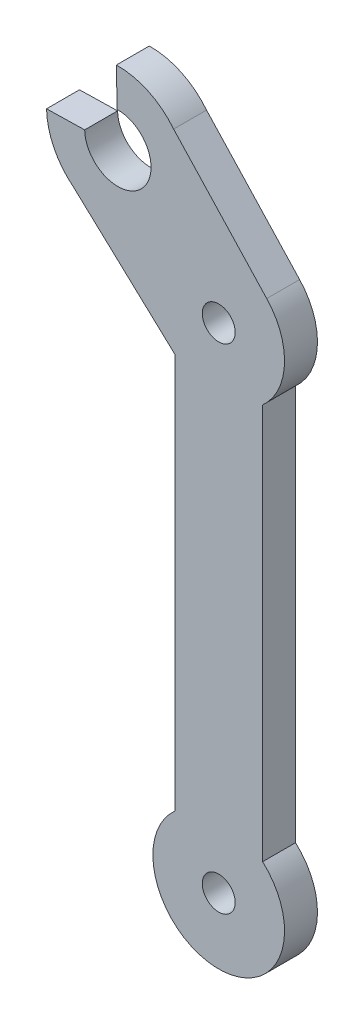
ISO-10303-21;
HEADER;
FILE_DESCRIPTION(('STEP AP214'),'2;1');
FILE_NAME('part.step','',(''),(''),'','','');
FILE_SCHEMA(('AUTOMOTIVE_DESIGN { 1 0 10303 214 1 1 1 1 }'));
ENDSEC;
DATA;
#1=APPLICATION_CONTEXT('core data for automotive mechanical design processes');
#2=APPLICATION_PROTOCOL_DEFINITION('international standard','automotive_design',2000,#1);
#3=PRODUCT_CONTEXT('',#1,'mechanical');
#4=PRODUCT('Part','Part','',(#3));
#5=PRODUCT_RELATED_PRODUCT_CATEGORY('part','',(#4));
#6=PRODUCT_DEFINITION_FORMATION('','',#4);
#7=PRODUCT_DEFINITION_CONTEXT('part definition',#1,'design');
#8=PRODUCT_DEFINITION('design','',#6,#7);
#9=PRODUCT_DEFINITION_SHAPE('','',#8);
#10=(LENGTH_UNIT() NAMED_UNIT(*) SI_UNIT(.MILLI.,.METRE.));
#11=(NAMED_UNIT(*) PLANE_ANGLE_UNIT() SI_UNIT($,.RADIAN.));
#12=(NAMED_UNIT(*) SI_UNIT($,.STERADIAN.) SOLID_ANGLE_UNIT());
#13=UNCERTAINTY_MEASURE_WITH_UNIT(LENGTH_MEASURE(1.E-05),#10,'distance_accuracy_value','');
#14=(GEOMETRIC_REPRESENTATION_CONTEXT(3) GLOBAL_UNCERTAINTY_ASSIGNED_CONTEXT((#13)) GLOBAL_UNIT_ASSIGNED_CONTEXT((#10,
#11,#12)) REPRESENTATION_CONTEXT('',''));
#15=CARTESIAN_POINT('',(0.,0.,0.));
#16=DIRECTION('',(0.,0.,1.));
#17=DIRECTION('',(1.,0.,0.));
#18=AXIS2_PLACEMENT_3D('',#15,#16,#17);
#19=CARTESIAN_POINT('',(0.,0.,3.));
#20=DIRECTION('',(-1.,0.,0.));
#21=DIRECTION('',(0.,-1.,0.));
#22=AXIS2_PLACEMENT_3D('',#19,#20,#21);
#23=PLANE('',#22);
#24=DIRECTION('',(0.,1.,0.));
#25=VECTOR('',#24,1.);
#26=CARTESIAN_POINT('',(0.,0.,0.));
#27=LINE('',#26,#25);
#28=CARTESIAN_POINT('',(0.,4.47213595499958,0.));
#29=VERTEX_POINT('',#28);
#30=CARTESIAN_POINT('',(0.,40.5278640450004,0.));
#31=VERTEX_POINT('',#30);
#32=EDGE_CURVE('E156',#29,#31,#27,.T.);
#33=ORIENTED_EDGE('',*,*,#32,.F.);
#34=DIRECTION('',(0.,0.,-1.));
#35=VECTOR('',#34,1.);
#36=CARTESIAN_POINT('',(0.,4.47213595499958,3.));
#37=LINE('',#36,#35);
#38=CARTESIAN_POINT('',(0.,4.47213595499958,3.));
#39=VERTEX_POINT('',#38);
#40=EDGE_CURVE('E11',#39,#29,#37,.T.);
#41=ORIENTED_EDGE('',*,*,#40,.F.);
#42=DIRECTION('',(0.,1.,0.));
#43=VECTOR('',#42,1.);
#44=CARTESIAN_POINT('',(0.,0.,3.));
#45=LINE('',#44,#43);
#46=CARTESIAN_POINT('',(0.,40.5278640450004,3.));
#47=VERTEX_POINT('',#46);
#48=EDGE_CURVE('E189',#39,#47,#45,.T.);
#49=ORIENTED_EDGE('',*,*,#48,.T.);
#50=DIRECTION('',(0.,0.,-1.));
#51=VECTOR('',#50,1.);
#52=CARTESIAN_POINT('',(0.,40.5278640450004,3.));
#53=LINE('',#52,#51);
#54=EDGE_CURVE('E53',#47,#31,#53,.T.);
#55=ORIENTED_EDGE('',*,*,#54,.T.);
#56=EDGE_LOOP('',(#33,#41,#49,#55));
#57=FACE_BOUND('',#56,.T.);
#58=ADVANCED_FACE('F37',(#57),#23,.T.);
#59=CARTESIAN_POINT('',(4.,0.,3.));
#60=DIRECTION('',(0.,0.,-1.));
#61=DIRECTION('',(-1.,0.,0.));
#62=AXIS2_PLACEMENT_3D('',#59,#60,#61);
#63=CYLINDRICAL_SURFACE('',#62,6.);
#64=CARTESIAN_POINT('',(4.,0.,0.));
#65=DIRECTION('',(0.,0.,1.));
#66=DIRECTION('',(1.,0.,0.));
#67=AXIS2_PLACEMENT_3D('',#64,#65,#66);
#68=CIRCLE('',#67,6.);
#69=CARTESIAN_POINT('',(8.,4.47213595499958,0.));
#70=VERTEX_POINT('',#69);
#71=EDGE_CURVE('E158',#29,#70,#68,.T.);
#72=ORIENTED_EDGE('',*,*,#71,.T.);
#73=DIRECTION('',(0.,0.,-1.));
#74=VECTOR('',#73,1.);
#75=CARTESIAN_POINT('',(8.,4.47213595499958,3.));
#76=LINE('',#75,#74);
#77=CARTESIAN_POINT('',(8.,4.47213595499958,3.));
#78=VERTEX_POINT('',#77);
#79=EDGE_CURVE('E45',#78,#70,#76,.T.);
#80=ORIENTED_EDGE('',*,*,#79,.F.);
#81=CARTESIAN_POINT('',(4.,0.,3.));
#82=DIRECTION('',(0.,0.,1.));
#83=DIRECTION('',(1.,0.,0.));
#84=AXIS2_PLACEMENT_3D('',#81,#82,#83);
#85=CIRCLE('',#84,6.);
#86=EDGE_CURVE('E230',#39,#78,#85,.T.);
#87=ORIENTED_EDGE('',*,*,#86,.F.);
#88=ORIENTED_EDGE('',*,*,#40,.T.);
#89=EDGE_LOOP('',(#72,#80,#87,#88));
#90=FACE_BOUND('',#89,.T.);
#91=ADVANCED_FACE('F256',(#90),#63,.T.);
#92=CARTESIAN_POINT('',(8.,0.,3.));
#93=DIRECTION('',(-1.,0.,0.));
#94=DIRECTION('',(0.,-1.,0.));
#95=AXIS2_PLACEMENT_3D('',#92,#93,#94);
#96=PLANE('',#95);
#97=DIRECTION('',(0.,1.,0.));
#98=VECTOR('',#97,1.);
#99=CARTESIAN_POINT('',(8.,0.,0.));
#100=LINE('',#99,#98);
#101=CARTESIAN_POINT('',(8.,40.5278640450004,0.));
#102=VERTEX_POINT('',#101);
#103=EDGE_CURVE('E160',#70,#102,#100,.T.);
#104=ORIENTED_EDGE('',*,*,#103,.T.);
#105=DIRECTION('',(0.,0.,-1.));
#106=VECTOR('',#105,1.);
#107=CARTESIAN_POINT('',(8.,40.5278640450004,3.));
#108=LINE('',#107,#106);
#109=CARTESIAN_POINT('',(8.,40.5278640450004,3.));
#110=VERTEX_POINT('',#109);
#111=EDGE_CURVE('E201',#110,#102,#108,.T.);
#112=ORIENTED_EDGE('',*,*,#111,.F.);
#113=DIRECTION('',(0.,1.,0.));
#114=VECTOR('',#113,1.);
#115=CARTESIAN_POINT('',(8.,0.,3.));
#116=LINE('',#115,#114);
#117=EDGE_CURVE('E210',#78,#110,#116,.T.);
#118=ORIENTED_EDGE('',*,*,#117,.F.);
#119=ORIENTED_EDGE('',*,*,#79,.T.);
#120=EDGE_LOOP('',(#104,#112,#118,#119));
#121=FACE_BOUND('',#120,.T.);
#122=ADVANCED_FACE('F208',(#121),#96,.F.);
#123=CARTESIAN_POINT('',(4.,45.,3.));
#124=DIRECTION('',(0.,0.,-1.));
#125=DIRECTION('',(-1.,0.,0.));
#126=AXIS2_PLACEMENT_3D('',#123,#124,#125);
#127=CYLINDRICAL_SURFACE('',#126,6.);
#128=CARTESIAN_POINT('',(4.,45.,0.));
#129=DIRECTION('',(0.,0.,1.));
#130=DIRECTION('',(1.,0.,0.));
#131=AXIS2_PLACEMENT_3D('',#128,#129,#130);
#132=CIRCLE('',#131,6.);
#133=CARTESIAN_POINT('',(8.37364085236499,49.1074646309523,0.));
#134=VERTEX_POINT('',#133);
#135=EDGE_CURVE('E162',#102,#134,#132,.T.);
#136=ORIENTED_EDGE('',*,*,#135,.T.);
#137=DIRECTION('',(0.,0.,-1.));
#138=VECTOR('',#137,1.);
#139=CARTESIAN_POINT('',(8.37364085236499,49.1074646309523,3.));
#140=LINE('',#139,#138);
#141=CARTESIAN_POINT('',(8.37364085236499,49.1074646309523,3.));
#142=VERTEX_POINT('',#141);
#143=EDGE_CURVE('E199',#142,#134,#140,.T.);
#144=ORIENTED_EDGE('',*,*,#143,.F.);
#145=CARTESIAN_POINT('',(4.,45.,3.));
#146=DIRECTION('',(0.,0.,1.));
#147=DIRECTION('',(1.,0.,0.));
#148=AXIS2_PLACEMENT_3D('',#145,#146,#147);
#149=CIRCLE('',#148,6.);
#150=EDGE_CURVE('E224',#110,#142,#149,.T.);
#151=ORIENTED_EDGE('',*,*,#150,.F.);
#152=ORIENTED_EDGE('',*,*,#111,.T.);
#153=EDGE_LOOP('',(#136,#144,#151,#152));
#154=FACE_BOUND('',#153,.T.);
#155=ADVANCED_FACE('F221',(#154),#127,.T.);
#156=CARTESIAN_POINT('',(28.983074799154,26.9119106318994,3.));
#157=DIRECTION('',(0.732805399614917,0.680438275154493,0.));
#158=DIRECTION('',(-0.680438275154493,0.732805399614917,0.));
#159=AXIS2_PLACEMENT_3D('',#156,#157,#158);
#160=PLANE('',#159);
#161=DIRECTION('',(0.680438275154493,-0.732805399614917,0.));
#162=VECTOR('',#161,1.);
#163=CARTESIAN_POINT('',(28.983074799154,26.9119106318994,0.));
#164=LINE('',#163,#162);
#165=CARTESIAN_POINT('',(-0.107464630952108,58.2412834060166,0.));
#166=VERTEX_POINT('',#165);
#167=EDGE_CURVE('E165',#166,#134,#164,.T.);
#168=ORIENTED_EDGE('',*,*,#167,.F.);
#169=DIRECTION('',(0.,0.,-1.));
#170=VECTOR('',#169,1.);
#171=CARTESIAN_POINT('',(-0.107464630952108,58.2412834060166,3.));
#172=LINE('',#171,#170);
#173=CARTESIAN_POINT('',(-0.107464630952108,58.2412834060166,3.));
#174=VERTEX_POINT('',#173);
#175=EDGE_CURVE('E197',#174,#166,#172,.T.);
#176=ORIENTED_EDGE('',*,*,#175,.F.);
#177=DIRECTION('',(0.680438275154493,-0.732805399614917,0.));
#178=VECTOR('',#177,1.);
#179=CARTESIAN_POINT('',(28.983074799154,26.9119106318994,3.));
#180=LINE('',#179,#178);
#181=EDGE_CURVE('E226',#174,#142,#180,.T.);
#182=ORIENTED_EDGE('',*,*,#181,.T.);
#183=ORIENTED_EDGE('',*,*,#143,.T.);
#184=EDGE_LOOP('',(#168,#176,#182,#183));
#185=FACE_BOUND('',#184,.T.);
#186=ADVANCED_FACE('F267',(#185),#160,.T.);
#187=CARTESIAN_POINT('',(-5.19238815542507,54.1923881554252,3.));
#188=DIRECTION('',(0.,0.,-1.));
#189=DIRECTION('',(-1.,0.,0.));
#190=AXIS2_PLACEMENT_3D('',#187,#188,#189);
#191=CYLINDRICAL_SURFACE('',#190,6.5);
#192=CARTESIAN_POINT('',(-5.19238815542507,54.1923881554252,0.));
#193=DIRECTION('',(0.,0.,1.));
#194=DIRECTION('',(1.,0.,0.));
#195=AXIS2_PLACEMENT_3D('',#192,#193,#194);
#196=CIRCLE('',#195,6.5);
#197=CARTESIAN_POINT('',(-5.32951474731763,60.690941555821,0.));
#198=VERTEX_POINT('',#197);
#199=EDGE_CURVE('E168',#166,#198,#196,.T.);
#200=ORIENTED_EDGE('',*,*,#199,.T.);
#201=DIRECTION('',(0.,0.,-1.));
#202=VECTOR('',#201,1.);
#203=CARTESIAN_POINT('',(-5.32951474731763,60.690941555821,3.));
#204=LINE('',#203,#202);
#205=CARTESIAN_POINT('',(-5.32951474731763,60.690941555821,3.));
#206=VERTEX_POINT('',#205);
#207=EDGE_CURVE('E195',#206,#198,#204,.T.);
#208=ORIENTED_EDGE('',*,*,#207,.F.);
#209=CARTESIAN_POINT('',(-5.19238815542507,54.1923881554252,3.));
#210=DIRECTION('',(0.,0.,1.));
#211=DIRECTION('',(1.,0.,0.));
#212=AXIS2_PLACEMENT_3D('',#209,#210,#211);
#213=CIRCLE('',#212,6.5);
#214=EDGE_CURVE('E228',#174,#206,#213,.T.);
#215=ORIENTED_EDGE('',*,*,#214,.F.);
#216=ORIENTED_EDGE('',*,*,#175,.T.);
#217=EDGE_LOOP('',(#200,#208,#215,#216));
#218=FACE_BOUND('',#217,.T.);
#219=ADVANCED_FACE('F270',(#218),#191,.T.);
#220=CARTESIAN_POINT('',(-4.04706744922179,-0.0853975542368137,3.));
#221=DIRECTION('',(-0.99977744621474,-0.0210963987527027,0.));
#222=DIRECTION('',(0.0210963987527027,-0.99977744621474,0.));
#223=AXIS2_PLACEMENT_3D('',#220,#221,#222);
#224=PLANE('',#223);
#225=DIRECTION('',(-0.0210963987527027,0.99977744621474,0.));
#226=VECTOR('',#225,1.);
#227=CARTESIAN_POINT('',(-4.04706744922179,-0.0853975542368137,0.));
#228=LINE('',#227,#226);
#229=CARTESIAN_POINT('',(-5.25620476165199,57.2167149302248,0.));
#230=VERTEX_POINT('',#229);
#231=EDGE_CURVE('E171',#230,#198,#228,.T.);
#232=ORIENTED_EDGE('',*,*,#231,.F.);
#233=DIRECTION('',(0.,0.,-1.));
#234=VECTOR('',#233,1.);
#235=CARTESIAN_POINT('',(-5.25620476165199,57.2167149302248,3.));
#236=LINE('',#235,#234);
#237=CARTESIAN_POINT('',(-5.25620476165199,57.2167149302248,3.));
#238=VERTEX_POINT('',#237);
#239=EDGE_CURVE('E193',#238,#230,#236,.T.);
#240=ORIENTED_EDGE('',*,*,#239,.F.);
#241=DIRECTION('',(-0.0210963987527027,0.99977744621474,0.));
#242=VECTOR('',#241,1.);
#243=CARTESIAN_POINT('',(-4.04706744922179,-0.0853975542368137,3.));
#244=LINE('',#243,#242);
#245=EDGE_CURVE('E235',#238,#206,#244,.T.);
#246=ORIENTED_EDGE('',*,*,#245,.T.);
#247=ORIENTED_EDGE('',*,*,#207,.T.);
#248=EDGE_LOOP('',(#232,#240,#246,#247));
#249=FACE_BOUND('',#248,.T.);
#250=ADVANCED_FACE('F274',(#249),#224,.T.);
#251=CARTESIAN_POINT('',(-5.19238815542507,54.1923881554252,3.));
#252=DIRECTION('',(0.,0.,-1.));
#253=DIRECTION('',(-1.,0.,0.));
#254=AXIS2_PLACEMENT_3D('',#251,#252,#253);
#255=CYLINDRICAL_SURFACE('',#254,3.025);
#256=CARTESIAN_POINT('',(-5.19238815542507,54.1923881554252,0.));
#257=DIRECTION('',(0.,0.,1.));
#258=DIRECTION('',(1.,0.,0.));
#259=AXIS2_PLACEMENT_3D('',#256,#257,#258);
#260=CIRCLE('',#259,3.025);
#261=CARTESIAN_POINT('',(-8.21671493022465,54.1285715491982,0.));
#262=VERTEX_POINT('',#261);
#263=EDGE_CURVE('E174',#262,#230,#260,.T.);
#264=ORIENTED_EDGE('',*,*,#263,.F.);
#265=DIRECTION('',(0.,0.,-1.));
#266=VECTOR('',#265,1.);
#267=CARTESIAN_POINT('',(-8.21671493022465,54.1285715491982,3.));
#268=LINE('',#267,#266);
#269=CARTESIAN_POINT('',(-8.21671493022465,54.1285715491982,3.));
#270=VERTEX_POINT('',#269);
#271=EDGE_CURVE('E142',#270,#262,#268,.T.);
#272=ORIENTED_EDGE('',*,*,#271,.F.);
#273=CARTESIAN_POINT('',(-5.19238815542507,54.1923881554252,3.));
#274=DIRECTION('',(0.,0.,1.));
#275=DIRECTION('',(1.,0.,0.));
#276=AXIS2_PLACEMENT_3D('',#273,#274,#275);
#277=CIRCLE('',#276,3.025);
#278=EDGE_CURVE('E132',#270,#238,#277,.T.);
#279=ORIENTED_EDGE('',*,*,#278,.T.);
#280=ORIENTED_EDGE('',*,*,#239,.T.);
#281=EDGE_LOOP('',(#264,#272,#279,#280));
#282=FACE_BOUND('',#281,.T.);
#283=ADVANCED_FACE('F239',(#282),#255,.F.);
#284=CARTESIAN_POINT('',(-1.14532070620347,54.277785709662,3.));
#285=DIRECTION('',(0.0210963987527061,-0.99977744621474,0.));
#286=DIRECTION('',(0.99977744621474,0.0210963987527061,0.));
#287=AXIS2_PLACEMENT_3D('',#284,#285,#286);
#288=PLANE('',#287);
#289=DIRECTION('',(-0.99977744621474,-0.0210963987527061,0.));
#290=VECTOR('',#289,1.);
#291=CARTESIAN_POINT('',(-1.14532070620347,54.277785709662,0.));
#292=LINE('',#291,#290);
#293=CARTESIAN_POINT('',(-11.6909415558209,54.0552615635326,0.));
#294=VERTEX_POINT('',#293);
#295=EDGE_CURVE('E139',#262,#294,#292,.T.);
#296=ORIENTED_EDGE('',*,*,#295,.T.);
#297=DIRECTION('',(0.,0.,-1.));
#298=VECTOR('',#297,1.);
#299=CARTESIAN_POINT('',(-11.6909415558209,54.0552615635326,3.));
#300=LINE('',#299,#298);
#301=CARTESIAN_POINT('',(-11.6909415558209,54.0552615635326,3.));
#302=VERTEX_POINT('',#301);
#303=EDGE_CURVE('E136',#302,#294,#300,.T.);
#304=ORIENTED_EDGE('',*,*,#303,.F.);
#305=DIRECTION('',(-0.99977744621474,-0.0210963987527061,0.));
#306=VECTOR('',#305,1.);
#307=CARTESIAN_POINT('',(-1.14532070620347,54.277785709662,3.));
#308=LINE('',#307,#306);
#309=EDGE_CURVE('E122',#270,#302,#308,.T.);
#310=ORIENTED_EDGE('',*,*,#309,.F.);
#311=ORIENTED_EDGE('',*,*,#271,.T.);
#312=EDGE_LOOP('',(#296,#304,#310,#311));
#313=FACE_BOUND('',#312,.T.);
#314=ADVANCED_FACE('F137',(#313),#288,.F.);
#315=CARTESIAN_POINT('',(-5.19238815542507,54.1923881554252,3.));
#316=DIRECTION('',(0.,0.,-1.));
#317=DIRECTION('',(-1.,0.,0.));
#318=AXIS2_PLACEMENT_3D('',#315,#316,#317);
#319=CYLINDRICAL_SURFACE('',#318,6.5);
#320=CARTESIAN_POINT('',(-5.19238815542507,54.1923881554252,0.));
#321=DIRECTION('',(0.,0.,1.));
#322=DIRECTION('',(1.,0.,0.));
#323=AXIS2_PLACEMENT_3D('',#320,#321,#322);
#324=CIRCLE('',#323,6.5);
#325=CARTESIAN_POINT('',(-9.24128340601612,49.1074646309519,0.));
#326=VERTEX_POINT('',#325);
#327=EDGE_CURVE('E178',#294,#326,#324,.T.);
#328=ORIENTED_EDGE('',*,*,#327,.T.);
#329=DIRECTION('',(0.,0.,-1.));
#330=VECTOR('',#329,1.);
#331=CARTESIAN_POINT('',(-9.24128340601612,49.1074646309519,3.));
#332=LINE('',#331,#330);
#333=CARTESIAN_POINT('',(-9.24128340601612,49.1074646309519,3.));
#334=VERTEX_POINT('',#333);
#335=EDGE_CURVE('E88',#334,#326,#332,.T.);
#336=ORIENTED_EDGE('',*,*,#335,.F.);
#337=CARTESIAN_POINT('',(-5.19238815542507,54.1923881554252,3.));
#338=DIRECTION('',(0.,0.,1.));
#339=DIRECTION('',(1.,0.,0.));
#340=AXIS2_PLACEMENT_3D('',#337,#338,#339);
#341=CIRCLE('',#340,6.5);
#342=EDGE_CURVE('E129',#302,#334,#341,.T.);
#343=ORIENTED_EDGE('',*,*,#342,.F.);
#344=ORIENTED_EDGE('',*,*,#303,.T.);
#345=EDGE_LOOP('',(#328,#336,#343,#344));
#346=FACE_BOUND('',#345,.T.);
#347=ADVANCED_FACE('F144',(#346),#319,.T.);
#348=CARTESIAN_POINT('',(4.,45.,3.));
#349=DIRECTION('',(0.,0.,-1.));
#350=DIRECTION('',(-1.,0.,0.));
#351=AXIS2_PLACEMENT_3D('',#348,#349,#350);
#352=CYLINDRICAL_SURFACE('',#351,1.5);
#353=CARTESIAN_POINT('',(4.,45.,3.));
#354=DIRECTION('',(0.,0.,1.));
#355=DIRECTION('',(1.,0.,0.));
#356=AXIS2_PLACEMENT_3D('',#353,#354,#355);
#357=CIRCLE('',#356,1.5);
#358=CARTESIAN_POINT('',(5.5,45.,3.));
#359=VERTEX_POINT('',#358);
#360=EDGE_CURVE('E147',#359,#359,#357,.T.);
#361=ORIENTED_EDGE('',*,*,#360,.T.);
#362=EDGE_LOOP('',(#361));
#363=FACE_BOUND('',#362,.T.);
#364=CARTESIAN_POINT('',(4.,45.,0.));
#365=DIRECTION('',(0.,0.,1.));
#366=DIRECTION('',(1.,0.,0.));
#367=AXIS2_PLACEMENT_3D('',#364,#365,#366);
#368=CIRCLE('',#367,1.5);
#369=CARTESIAN_POINT('',(5.5,45.,0.));
#370=VERTEX_POINT('',#369);
#371=EDGE_CURVE('E183',#370,#370,#368,.T.);
#372=ORIENTED_EDGE('',*,*,#371,.F.);
#373=EDGE_LOOP('',(#372));
#374=FACE_BOUND('',#373,.T.);
#375=ADVANCED_FACE('F244',(#363,#374),#352,.F.);
#376=CARTESIAN_POINT('',(20.2081368484377,21.7666449449591,3.));
#377=DIRECTION('',(-0.680383338479997,-0.732856406616476,0.));
#378=DIRECTION('',(0.732856406616476,-0.680383338479997,0.));
#379=AXIS2_PLACEMENT_3D('',#376,#377,#378);
#380=PLANE('',#379);
#381=DIRECTION('',(-0.732856406616476,0.680383338479997,0.));
#382=VECTOR('',#381,1.);
#383=CARTESIAN_POINT('',(20.2081368484377,21.7666449449591,0.));
#384=LINE('',#383,#382);
#385=EDGE_CURVE('E180',#31,#326,#384,.T.);
#386=ORIENTED_EDGE('',*,*,#385,.F.);
#387=ORIENTED_EDGE('',*,*,#54,.F.);
#388=DIRECTION('',(-0.732856406616476,0.680383338479997,0.));
#389=VECTOR('',#388,1.);
#390=CARTESIAN_POINT('',(20.2081368484377,21.7666449449591,3.));
#391=LINE('',#390,#389);
#392=EDGE_CURVE('E145',#47,#334,#391,.T.);
#393=ORIENTED_EDGE('',*,*,#392,.T.);
#394=ORIENTED_EDGE('',*,*,#335,.T.);
#395=EDGE_LOOP('',(#386,#387,#393,#394));
#396=FACE_BOUND('',#395,.T.);
#397=ADVANCED_FACE('F241',(#396),#380,.T.);
#398=CARTESIAN_POINT('',(4.,0.,3.));
#399=DIRECTION('',(0.,0.,-1.));
#400=DIRECTION('',(-1.,0.,0.));
#401=AXIS2_PLACEMENT_3D('',#398,#399,#400);
#402=CYLINDRICAL_SURFACE('',#401,1.5);
#403=CARTESIAN_POINT('',(4.,0.,3.));
#404=DIRECTION('',(0.,0.,1.));
#405=DIRECTION('',(1.,0.,0.));
#406=AXIS2_PLACEMENT_3D('',#403,#404,#405);
#407=CIRCLE('',#406,1.5);
#408=CARTESIAN_POINT('',(5.5,0.,3.));
#409=VERTEX_POINT('',#408);
#410=EDGE_CURVE('E153',#409,#409,#407,.T.);
#411=ORIENTED_EDGE('',*,*,#410,.T.);
#412=EDGE_LOOP('',(#411));
#413=FACE_BOUND('',#412,.T.);
#414=CARTESIAN_POINT('',(4.,0.,0.));
#415=DIRECTION('',(0.,0.,1.));
#416=DIRECTION('',(1.,0.,0.));
#417=AXIS2_PLACEMENT_3D('',#414,#415,#416);
#418=CIRCLE('',#417,1.5);
#419=CARTESIAN_POINT('',(5.5,0.,0.));
#420=VERTEX_POINT('',#419);
#421=EDGE_CURVE('E186',#420,#420,#418,.T.);
#422=ORIENTED_EDGE('',*,*,#421,.F.);
#423=EDGE_LOOP('',(#422));
#424=FACE_BOUND('',#423,.T.);
#425=ADVANCED_FACE('F243',(#413,#424),#402,.F.);
#426=CARTESIAN_POINT('',(0.,0.,3.));
#427=DIRECTION('',(0.,0.,1.));
#428=DIRECTION('',(1.,0.,0.));
#429=AXIS2_PLACEMENT_3D('',#426,#427,#428);
#430=PLANE('',#429);
#431=ORIENTED_EDGE('',*,*,#48,.F.);
#432=ORIENTED_EDGE('',*,*,#86,.T.);
#433=ORIENTED_EDGE('',*,*,#117,.T.);
#434=ORIENTED_EDGE('',*,*,#150,.T.);
#435=ORIENTED_EDGE('',*,*,#181,.F.);
#436=ORIENTED_EDGE('',*,*,#214,.T.);
#437=ORIENTED_EDGE('',*,*,#245,.F.);
#438=ORIENTED_EDGE('',*,*,#278,.F.);
#439=ORIENTED_EDGE('',*,*,#309,.T.);
#440=ORIENTED_EDGE('',*,*,#342,.T.);
#441=ORIENTED_EDGE('',*,*,#392,.F.);
#442=EDGE_LOOP('',(#431,#432,#433,#434,#435,#436,#437,#438,#439,#440,#441));
#443=FACE_BOUND('',#442,.T.);
#444=ORIENTED_EDGE('',*,*,#360,.F.);
#445=EDGE_LOOP('',(#444));
#446=FACE_BOUND('',#445,.T.);
#447=ORIENTED_EDGE('',*,*,#410,.F.);
#448=EDGE_LOOP('',(#447));
#449=FACE_BOUND('',#448,.T.);
#450=ADVANCED_FACE('F125',(#443,#446,#449),#430,.T.);
#451=CARTESIAN_POINT('',(0.,0.,0.));
#452=DIRECTION('',(0.,0.,1.));
#453=DIRECTION('',(1.,0.,0.));
#454=AXIS2_PLACEMENT_3D('',#451,#452,#453);
#455=PLANE('',#454);
#456=ORIENTED_EDGE('',*,*,#32,.T.);
#457=ORIENTED_EDGE('',*,*,#385,.T.);
#458=ORIENTED_EDGE('',*,*,#327,.F.);
#459=ORIENTED_EDGE('',*,*,#295,.F.);
#460=ORIENTED_EDGE('',*,*,#263,.T.);
#461=ORIENTED_EDGE('',*,*,#231,.T.);
#462=ORIENTED_EDGE('',*,*,#199,.F.);
#463=ORIENTED_EDGE('',*,*,#167,.T.);
#464=ORIENTED_EDGE('',*,*,#135,.F.);
#465=ORIENTED_EDGE('',*,*,#103,.F.);
#466=ORIENTED_EDGE('',*,*,#71,.F.);
#467=EDGE_LOOP('',(#456,#457,#458,#459,#460,#461,#462,#463,#464,#465,#466));
#468=FACE_BOUND('',#467,.T.);
#469=ORIENTED_EDGE('',*,*,#371,.T.);
#470=EDGE_LOOP('',(#469));
#471=FACE_BOUND('',#470,.T.);
#472=ORIENTED_EDGE('',*,*,#421,.T.);
#473=EDGE_LOOP('',(#472));
#474=FACE_BOUND('',#473,.T.);
#475=ADVANCED_FACE('F215',(#468,#471,#474),#455,.F.);
#476=CLOSED_SHELL('',(#58,#91,#122,#155,#186,#219,#250,#283,#314,#347,#375,#397,#425,#450,#475));
#477=MANIFOLD_SOLID_BREP('B2',#476);
#478=ADVANCED_BREP_SHAPE_REPRESENTATION('',(#18,#477),#14);
#479=SHAPE_DEFINITION_REPRESENTATION(#9,#478);
ENDSEC;
END-ISO-10303-21;
